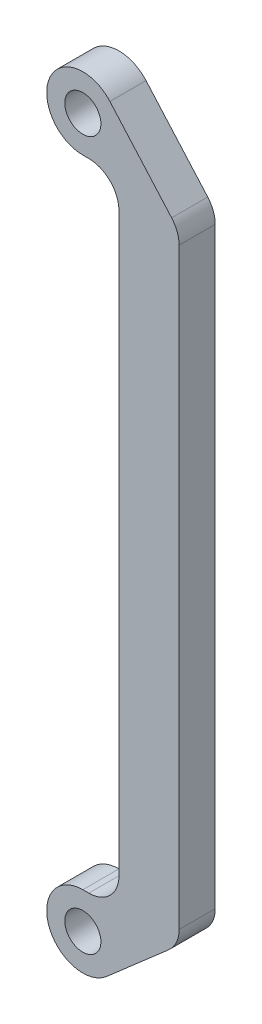
ISO-10303-21;
HEADER;
FILE_DESCRIPTION(('STEP AP214'),'2;1');
FILE_NAME('part.step','',(''),(''),'','','');
FILE_SCHEMA(('AUTOMOTIVE_DESIGN { 1 0 10303 214 1 1 1 1 }'));
ENDSEC;
DATA;
#1=APPLICATION_CONTEXT('core data for automotive mechanical design processes');
#2=APPLICATION_PROTOCOL_DEFINITION('international standard','automotive_design',2000,#1);
#3=PRODUCT_CONTEXT('',#1,'mechanical');
#4=PRODUCT('Part','Part','',(#3));
#5=PRODUCT_RELATED_PRODUCT_CATEGORY('part','',(#4));
#6=PRODUCT_DEFINITION_FORMATION('','',#4);
#7=PRODUCT_DEFINITION_CONTEXT('part definition',#1,'design');
#8=PRODUCT_DEFINITION('design','',#6,#7);
#9=PRODUCT_DEFINITION_SHAPE('','',#8);
#10=(LENGTH_UNIT() NAMED_UNIT(*) SI_UNIT(.MILLI.,.METRE.));
#11=(NAMED_UNIT(*) PLANE_ANGLE_UNIT() SI_UNIT($,.RADIAN.));
#12=(NAMED_UNIT(*) SI_UNIT($,.STERADIAN.) SOLID_ANGLE_UNIT());
#13=UNCERTAINTY_MEASURE_WITH_UNIT(LENGTH_MEASURE(1.E-05),#10,'distance_accuracy_value','');
#14=(GEOMETRIC_REPRESENTATION_CONTEXT(3) GLOBAL_UNCERTAINTY_ASSIGNED_CONTEXT((#13)) GLOBAL_UNIT_ASSIGNED_CONTEXT((#10,
#11,#12)) REPRESENTATION_CONTEXT('',''));
#15=CARTESIAN_POINT('',(0.,0.,0.));
#16=DIRECTION('',(0.,0.,1.));
#17=DIRECTION('',(1.,0.,0.));
#18=AXIS2_PLACEMENT_3D('',#15,#16,#17);
#19=CARTESIAN_POINT('',(0.,6.,6.));
#20=DIRECTION('',(0.,1.,0.));
#21=DIRECTION('',(0.,0.,1.));
#22=AXIS2_PLACEMENT_3D('',#19,#20,#21);
#23=PLANE('',#22);
#24=DIRECTION('',(1.,0.,0.));
#25=VECTOR('',#24,1.);
#26=CARTESIAN_POINT('',(0.,6.,0.));
#27=LINE('',#26,#25);
#28=CARTESIAN_POINT('',(0.,6.,0.));
#29=VERTEX_POINT('',#28);
#30=CARTESIAN_POINT('',(0.999999999999964,6.,0.));
#31=VERTEX_POINT('',#30);
#32=EDGE_CURVE('E159',#29,#31,#27,.T.);
#33=ORIENTED_EDGE('',*,*,#32,.F.);
#34=DIRECTION('',(0.,0.,-1.));
#35=VECTOR('',#34,1.);
#36=CARTESIAN_POINT('',(0.,6.,6.));
#37=LINE('',#36,#35);
#38=CARTESIAN_POINT('',(0.,6.,6.));
#39=VERTEX_POINT('',#38);
#40=EDGE_CURVE('E11',#39,#29,#37,.T.);
#41=ORIENTED_EDGE('',*,*,#40,.F.);
#42=DIRECTION('',(1.,0.,0.));
#43=VECTOR('',#42,1.);
#44=CARTESIAN_POINT('',(0.,6.,6.));
#45=LINE('',#44,#43);
#46=CARTESIAN_POINT('',(0.999999999999964,6.,6.));
#47=VERTEX_POINT('',#46);
#48=EDGE_CURVE('E195',#39,#47,#45,.T.);
#49=ORIENTED_EDGE('',*,*,#48,.T.);
#50=DIRECTION('',(0.,0.,-1.));
#51=VECTOR('',#50,1.);
#52=CARTESIAN_POINT('',(0.999999999999964,6.,6.));
#53=LINE('',#52,#51);
#54=EDGE_CURVE('E97',#47,#31,#53,.T.);
#55=ORIENTED_EDGE('',*,*,#54,.T.);
#56=EDGE_LOOP('',(#33,#41,#49,#55));
#57=FACE_BOUND('',#56,.T.);
#58=ADVANCED_FACE('F35',(#57),#23,.T.);
#59=CARTESIAN_POINT('',(0.,0.,6.));
#60=DIRECTION('',(0.,0.,-1.));
#61=DIRECTION('',(-1.,0.,0.));
#62=AXIS2_PLACEMENT_3D('',#59,#60,#61);
#63=CYLINDRICAL_SURFACE('',#62,6.);
#64=CARTESIAN_POINT('',(0.,0.,0.));
#65=DIRECTION('',(0.,0.,1.));
#66=DIRECTION('',(1.,0.,0.));
#67=AXIS2_PLACEMENT_3D('',#64,#65,#66);
#68=CIRCLE('',#67,6.);
#69=CARTESIAN_POINT('',(3.94520547945205,-4.52054794520548,0.));
#70=VERTEX_POINT('',#69);
#71=EDGE_CURVE('E162',#29,#70,#68,.T.);
#72=ORIENTED_EDGE('',*,*,#71,.T.);
#73=DIRECTION('',(0.,0.,-1.));
#74=VECTOR('',#73,1.);
#75=CARTESIAN_POINT('',(3.94520547945205,-4.52054794520548,6.));
#76=LINE('',#75,#74);
#77=CARTESIAN_POINT('',(3.94520547945205,-4.52054794520548,6.));
#78=VERTEX_POINT('',#77);
#79=EDGE_CURVE('E43',#78,#70,#76,.T.);
#80=ORIENTED_EDGE('',*,*,#79,.F.);
#81=CARTESIAN_POINT('',(0.,0.,6.));
#82=DIRECTION('',(0.,0.,1.));
#83=DIRECTION('',(1.,0.,0.));
#84=AXIS2_PLACEMENT_3D('',#81,#82,#83);
#85=CIRCLE('',#84,6.);
#86=EDGE_CURVE('E233',#39,#78,#85,.T.);
#87=ORIENTED_EDGE('',*,*,#86,.F.);
#88=ORIENTED_EDGE('',*,*,#40,.T.);
#89=EDGE_LOOP('',(#72,#80,#87,#88));
#90=FACE_BOUND('',#89,.T.);
#91=ADVANCED_FACE('F221',(#90),#63,.T.);
#92=CARTESIAN_POINT('',(3.94520547945205,-4.52054794520548,6.));
#93=DIRECTION('',(0.657534246575342,-0.753424657534247,0.));
#94=DIRECTION('',(0.753424657534247,0.657534246575342,0.));
#95=AXIS2_PLACEMENT_3D('',#92,#93,#94);
#96=PLANE('',#95);
#97=DIRECTION('',(-0.753424657534247,-0.657534246575342,0.));
#98=VECTOR('',#97,1.);
#99=CARTESIAN_POINT('',(3.94520547945205,-4.52054794520548,0.));
#100=LINE('',#99,#98);
#101=CARTESIAN_POINT('',(14.2876712328767,4.50560398505602,0.));
#102=VERTEX_POINT('',#101);
#103=EDGE_CURVE('E165',#102,#70,#100,.T.);
#104=ORIENTED_EDGE('',*,*,#103,.F.);
#105=DIRECTION('',(0.,0.,-1.));
#106=VECTOR('',#105,1.);
#107=CARTESIAN_POINT('',(14.2876712328767,4.50560398505602,6.));
#108=LINE('',#107,#106);
#109=CARTESIAN_POINT('',(14.2876712328767,4.50560398505602,6.));
#110=VERTEX_POINT('',#109);
#111=EDGE_CURVE('E211',#110,#102,#108,.T.);
#112=ORIENTED_EDGE('',*,*,#111,.F.);
#113=DIRECTION('',(-0.753424657534247,-0.657534246575342,0.));
#114=VECTOR('',#113,1.);
#115=CARTESIAN_POINT('',(3.94520547945205,-4.52054794520548,6.));
#116=LINE('',#115,#114);
#117=EDGE_CURVE('E218',#110,#78,#116,.T.);
#118=ORIENTED_EDGE('',*,*,#117,.T.);
#119=ORIENTED_EDGE('',*,*,#79,.T.);
#120=EDGE_LOOP('',(#104,#112,#118,#119));
#121=FACE_BOUND('',#120,.T.);
#122=ADVANCED_FACE('F216',(#121),#96,.T.);
#123=CARTESIAN_POINT('',(11.,8.27272727272727,6.));
#124=DIRECTION('',(0.,0.,-1.));
#125=DIRECTION('',(-1.,0.,0.));
#126=AXIS2_PLACEMENT_3D('',#123,#124,#125);
#127=CYLINDRICAL_SURFACE('',#126,5.);
#128=CARTESIAN_POINT('',(11.,8.27272727272727,0.));
#129=DIRECTION('',(0.,0.,1.));
#130=DIRECTION('',(1.,0.,0.));
#131=AXIS2_PLACEMENT_3D('',#128,#129,#130);
#132=CIRCLE('',#131,5.);
#133=CARTESIAN_POINT('',(16.,8.27272727272729,0.));
#134=VERTEX_POINT('',#133);
#135=EDGE_CURVE('E168',#134,#102,#132,.F.);
#136=ORIENTED_EDGE('',*,*,#135,.F.);
#137=DIRECTION('',(0.,0.,-1.));
#138=VECTOR('',#137,1.);
#139=CARTESIAN_POINT('',(16.,8.27272727272729,6.));
#140=LINE('',#139,#138);
#141=CARTESIAN_POINT('',(16.,8.27272727272729,6.));
#142=VERTEX_POINT('',#141);
#143=EDGE_CURVE('E209',#142,#134,#140,.T.);
#144=ORIENTED_EDGE('',*,*,#143,.F.);
#145=CARTESIAN_POINT('',(11.,8.27272727272727,6.));
#146=DIRECTION('',(0.,0.,1.));
#147=DIRECTION('',(1.,0.,0.));
#148=AXIS2_PLACEMENT_3D('',#145,#146,#147);
#149=CIRCLE('',#148,5.);
#150=EDGE_CURVE('E232',#142,#110,#149,.F.);
#151=ORIENTED_EDGE('',*,*,#150,.T.);
#152=ORIENTED_EDGE('',*,*,#111,.T.);
#153=EDGE_LOOP('',(#136,#144,#151,#152));
#154=FACE_BOUND('',#153,.T.);
#155=ADVANCED_FACE('F228',(#154),#127,.T.);
#156=CARTESIAN_POINT('',(16.,0.,6.));
#157=DIRECTION('',(-1.,0.,0.));
#158=DIRECTION('',(0.,-1.,0.));
#159=AXIS2_PLACEMENT_3D('',#156,#157,#158);
#160=PLANE('',#159);
#161=DIRECTION('',(0.,1.,0.));
#162=VECTOR('',#161,1.);
#163=CARTESIAN_POINT('',(16.,0.,0.));
#164=LINE('',#163,#162);
#165=CARTESIAN_POINT('',(16.,106.727272727273,0.));
#166=VERTEX_POINT('',#165);
#167=EDGE_CURVE('E171',#134,#166,#164,.T.);
#168=ORIENTED_EDGE('',*,*,#167,.T.);
#169=DIRECTION('',(0.,0.,-1.));
#170=VECTOR('',#169,1.);
#171=CARTESIAN_POINT('',(16.,106.727272727273,6.));
#172=LINE('',#171,#170);
#173=CARTESIAN_POINT('',(16.,106.727272727273,6.));
#174=VERTEX_POINT('',#173);
#175=EDGE_CURVE('E207',#174,#166,#172,.T.);
#176=ORIENTED_EDGE('',*,*,#175,.F.);
#177=DIRECTION('',(0.,1.,0.));
#178=VECTOR('',#177,1.);
#179=CARTESIAN_POINT('',(16.,0.,6.));
#180=LINE('',#179,#178);
#181=EDGE_CURVE('E235',#142,#174,#180,.T.);
#182=ORIENTED_EDGE('',*,*,#181,.F.);
#183=ORIENTED_EDGE('',*,*,#143,.T.);
#184=EDGE_LOOP('',(#168,#176,#182,#183));
#185=FACE_BOUND('',#184,.T.);
#186=ADVANCED_FACE('F270',(#185),#160,.F.);
#187=CARTESIAN_POINT('',(11.,106.727272727273,6.));
#188=DIRECTION('',(0.,0.,-1.));
#189=DIRECTION('',(-1.,0.,0.));
#190=AXIS2_PLACEMENT_3D('',#187,#188,#189);
#191=CYLINDRICAL_SURFACE('',#190,5.);
#192=CARTESIAN_POINT('',(11.,106.727272727273,0.));
#193=DIRECTION('',(0.,0.,1.));
#194=DIRECTION('',(1.,0.,0.));
#195=AXIS2_PLACEMENT_3D('',#192,#193,#194);
#196=CIRCLE('',#195,5.);
#197=CARTESIAN_POINT('',(14.7502480663763,110.034180564005,0.));
#198=VERTEX_POINT('',#197);
#199=EDGE_CURVE('E174',#198,#166,#196,.F.);
#200=ORIENTED_EDGE('',*,*,#199,.F.);
#201=DIRECTION('',(0.,0.,-1.));
#202=VECTOR('',#201,1.);
#203=CARTESIAN_POINT('',(14.7502480663763,110.034180564005,6.));
#204=LINE('',#203,#202);
#205=CARTESIAN_POINT('',(14.7502480663763,110.034180564005,6.));
#206=VERTEX_POINT('',#205);
#207=EDGE_CURVE('E205',#206,#198,#204,.T.);
#208=ORIENTED_EDGE('',*,*,#207,.F.);
#209=CARTESIAN_POINT('',(11.,106.727272727273,6.));
#210=DIRECTION('',(0.,0.,1.));
#211=DIRECTION('',(1.,0.,0.));
#212=AXIS2_PLACEMENT_3D('',#209,#210,#211);
#213=CIRCLE('',#212,5.);
#214=EDGE_CURVE('E241',#206,#174,#213,.F.);
#215=ORIENTED_EDGE('',*,*,#214,.T.);
#216=ORIENTED_EDGE('',*,*,#175,.T.);
#217=EDGE_LOOP('',(#200,#208,#215,#216));
#218=FACE_BOUND('',#217,.T.);
#219=ADVANCED_FACE('F273',(#218),#191,.T.);
#220=CARTESIAN_POINT('',(62.8826569733574,55.4489056348388,6.));
#221=DIRECTION('',(-0.750049613275263,-0.661381567346436,0.));
#222=DIRECTION('',(0.661381567346436,-0.750049613275263,0.));
#223=AXIS2_PLACEMENT_3D('',#220,#221,#222);
#224=PLANE('',#223);
#225=DIRECTION('',(-0.661381567346436,0.750049613275263,0.));
#226=VECTOR('',#225,1.);
#227=CARTESIAN_POINT('',(62.8826569733574,55.4489056348388,0.));
#228=LINE('',#227,#226);
#229=CARTESIAN_POINT('',(4.50029767965158,121.658289404079,0.));
#230=VERTEX_POINT('',#229);
#231=EDGE_CURVE('E177',#198,#230,#228,.T.);
#232=ORIENTED_EDGE('',*,*,#231,.T.);
#233=DIRECTION('',(0.,0.,-1.));
#234=VECTOR('',#233,1.);
#235=CARTESIAN_POINT('',(4.50029767965158,121.658289404079,6.));
#236=LINE('',#235,#234);
#237=CARTESIAN_POINT('',(4.50029767965158,121.658289404079,6.));
#238=VERTEX_POINT('',#237);
#239=EDGE_CURVE('E202',#238,#230,#236,.T.);
#240=ORIENTED_EDGE('',*,*,#239,.F.);
#241=DIRECTION('',(-0.661381567346436,0.750049613275263,0.));
#242=VECTOR('',#241,1.);
#243=CARTESIAN_POINT('',(62.8826569733574,55.4489056348388,6.));
#244=LINE('',#243,#242);
#245=EDGE_CURVE('E244',#206,#238,#244,.T.);
#246=ORIENTED_EDGE('',*,*,#245,.F.);
#247=ORIENTED_EDGE('',*,*,#207,.T.);
#248=EDGE_LOOP('',(#232,#240,#246,#247));
#249=FACE_BOUND('',#248,.T.);
#250=ADVANCED_FACE('F277',(#249),#224,.F.);
#251=CARTESIAN_POINT('',(0.,117.69,6.));
#252=DIRECTION('',(0.,0.,-1.));
#253=DIRECTION('',(-1.,0.,0.));
#254=AXIS2_PLACEMENT_3D('',#251,#252,#253);
#255=CYLINDRICAL_SURFACE('',#254,6.);
#256=CARTESIAN_POINT('',(0.,117.69,0.));
#257=DIRECTION('',(0.,0.,1.));
#258=DIRECTION('',(1.,0.,0.));
#259=AXIS2_PLACEMENT_3D('',#256,#257,#258);
#260=CIRCLE('',#259,6.);
#261=CARTESIAN_POINT('',(0.,111.69,0.));
#262=VERTEX_POINT('',#261);
#263=EDGE_CURVE('E179',#230,#262,#260,.T.);
#264=ORIENTED_EDGE('',*,*,#263,.T.);
#265=DIRECTION('',(0.,0.,-1.));
#266=VECTOR('',#265,1.);
#267=CARTESIAN_POINT('',(0.,111.69,6.));
#268=LINE('',#267,#266);
#269=CARTESIAN_POINT('',(0.,111.69,6.));
#270=VERTEX_POINT('',#269);
#271=EDGE_CURVE('E199',#270,#262,#268,.T.);
#272=ORIENTED_EDGE('',*,*,#271,.F.);
#273=CARTESIAN_POINT('',(0.,117.69,6.));
#274=DIRECTION('',(0.,0.,1.));
#275=DIRECTION('',(1.,0.,0.));
#276=AXIS2_PLACEMENT_3D('',#273,#274,#275);
#277=CIRCLE('',#276,6.);
#278=EDGE_CURVE('E246',#238,#270,#277,.T.);
#279=ORIENTED_EDGE('',*,*,#278,.F.);
#280=ORIENTED_EDGE('',*,*,#239,.T.);
#281=EDGE_LOOP('',(#264,#272,#279,#280));
#282=FACE_BOUND('',#281,.T.);
#283=ADVANCED_FACE('F253',(#282),#255,.T.);
#284=CARTESIAN_POINT('',(0.,111.69,6.));
#285=DIRECTION('',(0.,1.,0.));
#286=DIRECTION('',(0.,0.,1.));
#287=AXIS2_PLACEMENT_3D('',#284,#285,#286);
#288=PLANE('',#287);
#289=DIRECTION('',(1.,0.,0.));
#290=VECTOR('',#289,1.);
#291=CARTESIAN_POINT('',(0.,111.69,0.));
#292=LINE('',#291,#290);
#293=CARTESIAN_POINT('',(1.,111.69,0.));
#294=VERTEX_POINT('',#293);
#295=EDGE_CURVE('E181',#262,#294,#292,.T.);
#296=ORIENTED_EDGE('',*,*,#295,.T.);
#297=DIRECTION('',(0.,0.,-1.));
#298=VECTOR('',#297,1.);
#299=CARTESIAN_POINT('',(1.,111.69,6.));
#300=LINE('',#299,#298);
#301=CARTESIAN_POINT('',(1.,111.69,6.));
#302=VERTEX_POINT('',#301);
#303=EDGE_CURVE('E139',#302,#294,#300,.T.);
#304=ORIENTED_EDGE('',*,*,#303,.F.);
#305=DIRECTION('',(1.,0.,0.));
#306=VECTOR('',#305,1.);
#307=CARTESIAN_POINT('',(0.,111.69,6.));
#308=LINE('',#307,#306);
#309=EDGE_CURVE('E145',#270,#302,#308,.T.);
#310=ORIENTED_EDGE('',*,*,#309,.F.);
#311=ORIENTED_EDGE('',*,*,#271,.T.);
#312=EDGE_LOOP('',(#296,#304,#310,#311));
#313=FACE_BOUND('',#312,.T.);
#314=ADVANCED_FACE('F257',(#313),#288,.F.);
#315=CARTESIAN_POINT('',(1.,106.69,6.));
#316=DIRECTION('',(0.,0.,-1.));
#317=DIRECTION('',(-1.,0.,0.));
#318=AXIS2_PLACEMENT_3D('',#315,#316,#317);
#319=CYLINDRICAL_SURFACE('',#318,5.);
#320=CARTESIAN_POINT('',(1.,106.69,0.));
#321=DIRECTION('',(0.,0.,1.));
#322=DIRECTION('',(1.,0.,0.));
#323=AXIS2_PLACEMENT_3D('',#320,#321,#322);
#324=CIRCLE('',#323,5.);
#325=CARTESIAN_POINT('',(6.,106.69,0.));
#326=VERTEX_POINT('',#325);
#327=EDGE_CURVE('E134',#326,#294,#324,.T.);
#328=ORIENTED_EDGE('',*,*,#327,.F.);
#329=DIRECTION('',(0.,0.,-1.));
#330=VECTOR('',#329,1.);
#331=CARTESIAN_POINT('',(6.,106.69,6.));
#332=LINE('',#331,#330);
#333=CARTESIAN_POINT('',(6.,106.69,6.));
#334=VERTEX_POINT('',#333);
#335=EDGE_CURVE('E129',#334,#326,#332,.T.);
#336=ORIENTED_EDGE('',*,*,#335,.F.);
#337=CARTESIAN_POINT('',(1.,106.69,6.));
#338=DIRECTION('',(0.,0.,1.));
#339=DIRECTION('',(1.,0.,0.));
#340=AXIS2_PLACEMENT_3D('',#337,#338,#339);
#341=CIRCLE('',#340,5.);
#342=EDGE_CURVE('E132',#334,#302,#341,.T.);
#343=ORIENTED_EDGE('',*,*,#342,.T.);
#344=ORIENTED_EDGE('',*,*,#303,.T.);
#345=EDGE_LOOP('',(#328,#336,#343,#344));
#346=FACE_BOUND('',#345,.T.);
#347=ADVANCED_FACE('F131',(#346),#319,.F.);
#348=CARTESIAN_POINT('',(6.,0.,6.));
#349=DIRECTION('',(-1.,0.,0.));
#350=DIRECTION('',(0.,-1.,0.));
#351=AXIS2_PLACEMENT_3D('',#348,#349,#350);
#352=PLANE('',#351);
#353=DIRECTION('',(0.,1.,0.));
#354=VECTOR('',#353,1.);
#355=CARTESIAN_POINT('',(6.,0.,0.));
#356=LINE('',#355,#354);
#357=CARTESIAN_POINT('',(6.,11.,0.));
#358=VERTEX_POINT('',#357);
#359=EDGE_CURVE('E185',#358,#326,#356,.T.);
#360=ORIENTED_EDGE('',*,*,#359,.F.);
#361=DIRECTION('',(0.,0.,-1.));
#362=VECTOR('',#361,1.);
#363=CARTESIAN_POINT('',(6.,11.,6.));
#364=LINE('',#363,#362);
#365=CARTESIAN_POINT('',(6.,11.,6.));
#366=VERTEX_POINT('',#365);
#367=EDGE_CURVE('E90',#366,#358,#364,.T.);
#368=ORIENTED_EDGE('',*,*,#367,.F.);
#369=DIRECTION('',(0.,1.,0.));
#370=VECTOR('',#369,1.);
#371=CARTESIAN_POINT('',(6.,0.,6.));
#372=LINE('',#371,#370);
#373=EDGE_CURVE('E143',#366,#334,#372,.T.);
#374=ORIENTED_EDGE('',*,*,#373,.T.);
#375=ORIENTED_EDGE('',*,*,#335,.T.);
#376=EDGE_LOOP('',(#360,#368,#374,#375));
#377=FACE_BOUND('',#376,.T.);
#378=ADVANCED_FACE('F148',(#377),#352,.T.);
#379=CARTESIAN_POINT('',(0.,0.,6.));
#380=DIRECTION('',(0.,0.,-1.));
#381=DIRECTION('',(-1.,0.,0.));
#382=AXIS2_PLACEMENT_3D('',#379,#380,#381);
#383=CYLINDRICAL_SURFACE('',#382,3.);
#384=CARTESIAN_POINT('',(0.,0.,6.));
#385=DIRECTION('',(0.,0.,1.));
#386=DIRECTION('',(1.,0.,0.));
#387=AXIS2_PLACEMENT_3D('',#384,#385,#386);
#388=CIRCLE('',#387,3.);
#389=CARTESIAN_POINT('',(3.,0.,6.));
#390=VERTEX_POINT('',#389);
#391=EDGE_CURVE('E150',#390,#390,#388,.T.);
#392=ORIENTED_EDGE('',*,*,#391,.T.);
#393=EDGE_LOOP('',(#392));
#394=FACE_BOUND('',#393,.T.);
#395=CARTESIAN_POINT('',(0.,0.,0.));
#396=DIRECTION('',(0.,0.,1.));
#397=DIRECTION('',(1.,0.,0.));
#398=AXIS2_PLACEMENT_3D('',#395,#396,#397);
#399=CIRCLE('',#398,3.);
#400=CARTESIAN_POINT('',(3.,0.,0.));
#401=VERTEX_POINT('',#400);
#402=EDGE_CURVE('E189',#401,#401,#399,.T.);
#403=ORIENTED_EDGE('',*,*,#402,.F.);
#404=EDGE_LOOP('',(#403));
#405=FACE_BOUND('',#404,.T.);
#406=ADVANCED_FACE('F290',(#394,#405),#383,.F.);
#407=CARTESIAN_POINT('',(1.,11.,6.));
#408=DIRECTION('',(0.,0.,-1.));
#409=DIRECTION('',(-1.,0.,0.));
#410=AXIS2_PLACEMENT_3D('',#407,#408,#409);
#411=CYLINDRICAL_SURFACE('',#410,5.);
#412=CARTESIAN_POINT('',(1.,11.,0.));
#413=DIRECTION('',(0.,0.,1.));
#414=DIRECTION('',(1.,0.,0.));
#415=AXIS2_PLACEMENT_3D('',#412,#413,#414);
#416=CIRCLE('',#415,5.);
#417=EDGE_CURVE('E187',#358,#31,#416,.F.);
#418=ORIENTED_EDGE('',*,*,#417,.T.);
#419=ORIENTED_EDGE('',*,*,#54,.F.);
#420=CARTESIAN_POINT('',(1.,11.,6.));
#421=DIRECTION('',(0.,0.,1.));
#422=DIRECTION('',(1.,0.,0.));
#423=AXIS2_PLACEMENT_3D('',#420,#421,#422);
#424=CIRCLE('',#423,5.);
#425=EDGE_CURVE('E51',#366,#47,#424,.F.);
#426=ORIENTED_EDGE('',*,*,#425,.F.);
#427=ORIENTED_EDGE('',*,*,#367,.T.);
#428=EDGE_LOOP('',(#418,#419,#426,#427));
#429=FACE_BOUND('',#428,.T.);
#430=ADVANCED_FACE('F258',(#429),#411,.F.);
#431=CARTESIAN_POINT('',(0.,117.69,6.));
#432=DIRECTION('',(0.,0.,-1.));
#433=DIRECTION('',(-1.,0.,0.));
#434=AXIS2_PLACEMENT_3D('',#431,#432,#433);
#435=CYLINDRICAL_SURFACE('',#434,3.);
#436=CARTESIAN_POINT('',(0.,117.69,6.));
#437=DIRECTION('',(0.,0.,1.));
#438=DIRECTION('',(1.,0.,0.));
#439=AXIS2_PLACEMENT_3D('',#436,#437,#438);
#440=CIRCLE('',#439,3.);
#441=CARTESIAN_POINT('',(3.,117.69,6.));
#442=VERTEX_POINT('',#441);
#443=EDGE_CURVE('E156',#442,#442,#440,.T.);
#444=ORIENTED_EDGE('',*,*,#443,.T.);
#445=EDGE_LOOP('',(#444));
#446=FACE_BOUND('',#445,.T.);
#447=CARTESIAN_POINT('',(0.,117.69,0.));
#448=DIRECTION('',(0.,0.,1.));
#449=DIRECTION('',(1.,0.,0.));
#450=AXIS2_PLACEMENT_3D('',#447,#448,#449);
#451=CIRCLE('',#450,3.);
#452=CARTESIAN_POINT('',(3.,117.69,0.));
#453=VERTEX_POINT('',#452);
#454=EDGE_CURVE('E192',#453,#453,#451,.T.);
#455=ORIENTED_EDGE('',*,*,#454,.F.);
#456=EDGE_LOOP('',(#455));
#457=FACE_BOUND('',#456,.T.);
#458=ADVANCED_FACE('F293',(#446,#457),#435,.F.);
#459=CARTESIAN_POINT('',(0.,0.,6.));
#460=DIRECTION('',(0.,0.,1.));
#461=DIRECTION('',(1.,0.,0.));
#462=AXIS2_PLACEMENT_3D('',#459,#460,#461);
#463=PLANE('',#462);
#464=ORIENTED_EDGE('',*,*,#48,.F.);
#465=ORIENTED_EDGE('',*,*,#86,.T.);
#466=ORIENTED_EDGE('',*,*,#117,.F.);
#467=ORIENTED_EDGE('',*,*,#150,.F.);
#468=ORIENTED_EDGE('',*,*,#181,.T.);
#469=ORIENTED_EDGE('',*,*,#214,.F.);
#470=ORIENTED_EDGE('',*,*,#245,.T.);
#471=ORIENTED_EDGE('',*,*,#278,.T.);
#472=ORIENTED_EDGE('',*,*,#309,.T.);
#473=ORIENTED_EDGE('',*,*,#342,.F.);
#474=ORIENTED_EDGE('',*,*,#373,.F.);
#475=ORIENTED_EDGE('',*,*,#425,.T.);
#476=EDGE_LOOP('',(#464,#465,#466,#467,#468,#469,#470,#471,#472,#473,#474,#475));
#477=FACE_BOUND('',#476,.T.);
#478=ORIENTED_EDGE('',*,*,#391,.F.);
#479=EDGE_LOOP('',(#478));
#480=FACE_BOUND('',#479,.T.);
#481=ORIENTED_EDGE('',*,*,#443,.F.);
#482=EDGE_LOOP('',(#481));
#483=FACE_BOUND('',#482,.T.);
#484=ADVANCED_FACE('F141',(#477,#480,#483),#463,.T.);
#485=CARTESIAN_POINT('',(0.,0.,0.));
#486=DIRECTION('',(0.,0.,1.));
#487=DIRECTION('',(1.,0.,0.));
#488=AXIS2_PLACEMENT_3D('',#485,#486,#487);
#489=PLANE('',#488);
#490=ORIENTED_EDGE('',*,*,#32,.T.);
#491=ORIENTED_EDGE('',*,*,#417,.F.);
#492=ORIENTED_EDGE('',*,*,#359,.T.);
#493=ORIENTED_EDGE('',*,*,#327,.T.);
#494=ORIENTED_EDGE('',*,*,#295,.F.);
#495=ORIENTED_EDGE('',*,*,#263,.F.);
#496=ORIENTED_EDGE('',*,*,#231,.F.);
#497=ORIENTED_EDGE('',*,*,#199,.T.);
#498=ORIENTED_EDGE('',*,*,#167,.F.);
#499=ORIENTED_EDGE('',*,*,#135,.T.);
#500=ORIENTED_EDGE('',*,*,#103,.T.);
#501=ORIENTED_EDGE('',*,*,#71,.F.);
#502=EDGE_LOOP('',(#490,#491,#492,#493,#494,#495,#496,#497,#498,#499,#500,#501));
#503=FACE_BOUND('',#502,.T.);
#504=ORIENTED_EDGE('',*,*,#402,.T.);
#505=EDGE_LOOP('',(#504));
#506=FACE_BOUND('',#505,.T.);
#507=ORIENTED_EDGE('',*,*,#454,.T.);
#508=EDGE_LOOP('',(#507));
#509=FACE_BOUND('',#508,.T.);
#510=ADVANCED_FACE('F223',(#503,#506,#509),#489,.F.);
#511=CLOSED_SHELL('',(#58,#91,#122,#155,#186,#219,#250,#283,#314,#347,#378,#406,#430,#458,#484,#510));
#512=MANIFOLD_SOLID_BREP('B2',#511);
#513=ADVANCED_BREP_SHAPE_REPRESENTATION('',(#18,#512),#14);
#514=SHAPE_DEFINITION_REPRESENTATION(#9,#513);
ENDSEC;
END-ISO-10303-21;
